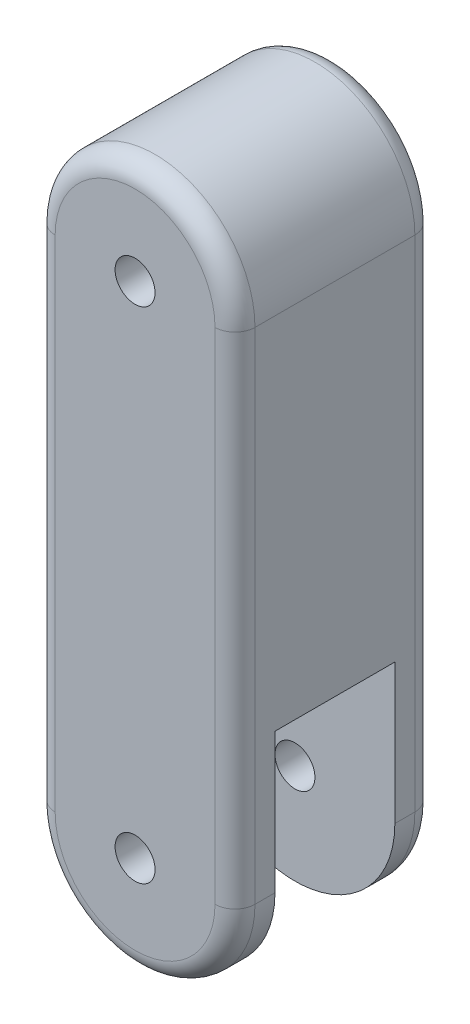
ISO-10303-21;
HEADER;
FILE_DESCRIPTION(('STEP AP214'),'2;1');
FILE_NAME('part.step','',(''),(''),'','','');
FILE_SCHEMA(('AUTOMOTIVE_DESIGN { 1 0 10303 214 1 1 1 1 }'));
ENDSEC;
DATA;
#1=APPLICATION_CONTEXT('core data for automotive mechanical design processes');
#2=APPLICATION_PROTOCOL_DEFINITION('international standard','automotive_design',2000,#1);
#3=PRODUCT_CONTEXT('',#1,'mechanical');
#4=PRODUCT('Part','Part','',(#3));
#5=PRODUCT_RELATED_PRODUCT_CATEGORY('part','',(#4));
#6=PRODUCT_DEFINITION_FORMATION('','',#4);
#7=PRODUCT_DEFINITION_CONTEXT('part definition',#1,'design');
#8=PRODUCT_DEFINITION('design','',#6,#7);
#9=PRODUCT_DEFINITION_SHAPE('','',#8);
#10=(LENGTH_UNIT() NAMED_UNIT(*) SI_UNIT(.MILLI.,.METRE.));
#11=(NAMED_UNIT(*) PLANE_ANGLE_UNIT() SI_UNIT($,.RADIAN.));
#12=(NAMED_UNIT(*) SI_UNIT($,.STERADIAN.) SOLID_ANGLE_UNIT());
#13=UNCERTAINTY_MEASURE_WITH_UNIT(LENGTH_MEASURE(1.E-05),#10,'distance_accuracy_value','');
#14=(GEOMETRIC_REPRESENTATION_CONTEXT(3) GLOBAL_UNCERTAINTY_ASSIGNED_CONTEXT((#13)) GLOBAL_UNIT_ASSIGNED_CONTEXT((#10,
#11,#12)) REPRESENTATION_CONTEXT('',''));
#15=CARTESIAN_POINT('',(0.,0.,0.));
#16=DIRECTION('',(0.,0.,1.));
#17=DIRECTION('',(1.,0.,0.));
#18=AXIS2_PLACEMENT_3D('',#15,#16,#17);
#19=CARTESIAN_POINT('',(2.,0.,0.5));
#20=DIRECTION('',(0.,1.,0.));
#21=DIRECTION('',(-1.,0.,0.));
#22=AXIS2_PLACEMENT_3D('',#19,#20,#21);
#23=CYLINDRICAL_SURFACE('',#22,0.5);
#24=CARTESIAN_POINT('',(2.,-12.5,0.5));
#25=DIRECTION('',(0.,-1.,0.));
#26=DIRECTION('',(0.,0.,-1.));
#27=AXIS2_PLACEMENT_3D('',#24,#25,#26);
#28=CIRCLE('',#27,0.5);
#29=CARTESIAN_POINT('',(2.,-12.5,0.));
#30=VERTEX_POINT('',#29);
#31=CARTESIAN_POINT('',(2.5,-12.5,0.5));
#32=VERTEX_POINT('',#31);
#33=EDGE_CURVE('E11',#30,#32,#28,.T.);
#34=ORIENTED_EDGE('',*,*,#33,.F.);
#35=DIRECTION('',(0.,-1.,0.));
#36=VECTOR('',#35,1.);
#37=CARTESIAN_POINT('',(2.,0.,0.));
#38=LINE('',#37,#36);
#39=CARTESIAN_POINT('',(2.,0.,0.));
#40=VERTEX_POINT('',#39);
#41=EDGE_CURVE('E262',#40,#30,#38,.T.);
#42=ORIENTED_EDGE('',*,*,#41,.F.);
#43=CARTESIAN_POINT('',(2.,0.,0.5));
#44=DIRECTION('',(0.,-1.,0.));
#45=DIRECTION('',(1.,0.,0.));
#46=AXIS2_PLACEMENT_3D('',#43,#44,#45);
#47=CIRCLE('',#46,0.5);
#48=CARTESIAN_POINT('',(2.5,0.,0.5));
#49=VERTEX_POINT('',#48);
#50=EDGE_CURVE('E48',#40,#49,#47,.T.);
#51=ORIENTED_EDGE('',*,*,#50,.T.);
#52=DIRECTION('',(0.,-1.,0.));
#53=VECTOR('',#52,1.);
#54=CARTESIAN_POINT('',(2.5,0.,0.5));
#55=LINE('',#54,#53);
#56=EDGE_CURVE('E289',#32,#49,#55,.F.);
#57=ORIENTED_EDGE('',*,*,#56,.F.);
#58=EDGE_LOOP('',(#34,#42,#51,#57));
#59=FACE_BOUND('',#58,.T.);
#60=ADVANCED_FACE('F40',(#59),#23,.T.);
#61=CARTESIAN_POINT('',(0.,0.,0.5));
#62=DIRECTION('',(0.,0.,1.));
#63=DIRECTION('',(1.,0.,0.));
#64=AXIS2_PLACEMENT_3D('',#61,#62,#63);
#65=TOROIDAL_SURFACE('',#64,2.,0.5);
#66=ORIENTED_EDGE('',*,*,#50,.F.);
#67=CARTESIAN_POINT('',(0.,0.,0.));
#68=DIRECTION('',(0.,0.,1.));
#69=DIRECTION('',(1.,0.,0.));
#70=AXIS2_PLACEMENT_3D('',#67,#68,#69);
#71=CIRCLE('',#70,2.);
#72=CARTESIAN_POINT('',(-2.,0.,0.));
#73=VERTEX_POINT('',#72);
#74=EDGE_CURVE('E266',#73,#40,#71,.F.);
#75=ORIENTED_EDGE('',*,*,#74,.F.);
#76=CARTESIAN_POINT('',(-2.,0.,0.5));
#77=DIRECTION('',(0.,1.,0.));
#78=DIRECTION('',(-1.,0.,0.));
#79=AXIS2_PLACEMENT_3D('',#76,#77,#78);
#80=CIRCLE('',#79,0.5);
#81=CARTESIAN_POINT('',(-2.5,0.,0.5));
#82=VERTEX_POINT('',#81);
#83=EDGE_CURVE('E62',#73,#82,#80,.T.);
#84=ORIENTED_EDGE('',*,*,#83,.T.);
#85=CARTESIAN_POINT('',(0.,0.,0.5));
#86=DIRECTION('',(0.,0.,1.));
#87=DIRECTION('',(1.,0.,0.));
#88=AXIS2_PLACEMENT_3D('',#85,#86,#87);
#89=CIRCLE('',#88,2.5);
#90=EDGE_CURVE('E286',#49,#82,#89,.T.);
#91=ORIENTED_EDGE('',*,*,#90,.F.);
#92=EDGE_LOOP('',(#66,#75,#84,#91));
#93=FACE_BOUND('',#92,.T.);
#94=ADVANCED_FACE('F313',(#93),#65,.T.);
#95=CARTESIAN_POINT('',(-2.,0.,0.5));
#96=DIRECTION('',(0.,1.,0.));
#97=DIRECTION('',(-1.,0.,0.));
#98=AXIS2_PLACEMENT_3D('',#95,#96,#97);
#99=CYLINDRICAL_SURFACE('',#98,0.5);
#100=ORIENTED_EDGE('',*,*,#83,.F.);
#101=DIRECTION('',(0.,1.,0.));
#102=VECTOR('',#101,1.);
#103=CARTESIAN_POINT('',(-2.,0.,0.));
#104=LINE('',#103,#102);
#105=CARTESIAN_POINT('',(-2.,-12.5,0.));
#106=VERTEX_POINT('',#105);
#107=EDGE_CURVE('E270',#106,#73,#104,.T.);
#108=ORIENTED_EDGE('',*,*,#107,.F.);
#109=CARTESIAN_POINT('',(-2.,-12.5,0.5));
#110=DIRECTION('',(0.,1.,0.));
#111=DIRECTION('',(0.,0.,1.));
#112=AXIS2_PLACEMENT_3D('',#109,#110,#111);
#113=CIRCLE('',#112,0.5);
#114=CARTESIAN_POINT('',(-2.5,-12.5,0.5));
#115=VERTEX_POINT('',#114);
#116=EDGE_CURVE('E292',#106,#115,#113,.T.);
#117=ORIENTED_EDGE('',*,*,#116,.T.);
#118=DIRECTION('',(0.,1.,0.));
#119=VECTOR('',#118,1.);
#120=CARTESIAN_POINT('',(-2.5,0.,0.5));
#121=LINE('',#120,#119);
#122=EDGE_CURVE('E282',#82,#115,#121,.F.);
#123=ORIENTED_EDGE('',*,*,#122,.F.);
#124=EDGE_LOOP('',(#100,#108,#117,#123));
#125=FACE_BOUND('',#124,.T.);
#126=ADVANCED_FACE('F318',(#125),#99,.T.);
#127=CARTESIAN_POINT('',(0.,-12.5,0.5));
#128=DIRECTION('',(0.,0.,1.));
#129=DIRECTION('',(1.,0.,0.));
#130=AXIS2_PLACEMENT_3D('',#127,#128,#129);
#131=TOROIDAL_SURFACE('',#130,2.,0.5);
#132=CARTESIAN_POINT('',(0.,-12.5,0.));
#133=DIRECTION('',(0.,0.,1.));
#134=DIRECTION('',(1.,0.,0.));
#135=AXIS2_PLACEMENT_3D('',#132,#133,#134);
#136=CIRCLE('',#135,2.);
#137=EDGE_CURVE('E274',#30,#106,#136,.F.);
#138=ORIENTED_EDGE('',*,*,#137,.F.);
#139=ORIENTED_EDGE('',*,*,#33,.T.);
#140=CARTESIAN_POINT('',(0.,-12.5,0.5));
#141=DIRECTION('',(0.,0.,1.));
#142=DIRECTION('',(1.,0.,0.));
#143=AXIS2_PLACEMENT_3D('',#140,#141,#142);
#144=CIRCLE('',#143,2.5);
#145=EDGE_CURVE('E278',#115,#32,#144,.T.);
#146=ORIENTED_EDGE('',*,*,#145,.F.);
#147=ORIENTED_EDGE('',*,*,#116,.F.);
#148=EDGE_LOOP('',(#138,#139,#146,#147));
#149=FACE_BOUND('',#148,.T.);
#150=ADVANCED_FACE('F311',(#149),#131,.T.);
#151=CARTESIAN_POINT('',(-2.,0.,4.5));
#152=DIRECTION('',(0.,1.,0.));
#153=DIRECTION('',(-1.,0.,0.));
#154=AXIS2_PLACEMENT_3D('',#151,#152,#153);
#155=CYLINDRICAL_SURFACE('',#154,0.5);
#156=CARTESIAN_POINT('',(-2.,-12.5,4.5));
#157=DIRECTION('',(0.,-1.,0.));
#158=DIRECTION('',(0.,0.,-1.));
#159=AXIS2_PLACEMENT_3D('',#156,#157,#158);
#160=CIRCLE('',#159,0.5);
#161=CARTESIAN_POINT('',(-2.,-12.5,5.));
#162=VERTEX_POINT('',#161);
#163=CARTESIAN_POINT('',(-2.5,-12.5,4.5));
#164=VERTEX_POINT('',#163);
#165=EDGE_CURVE('E259',#162,#164,#160,.T.);
#166=ORIENTED_EDGE('',*,*,#165,.F.);
#167=DIRECTION('',(0.,-1.,0.));
#168=VECTOR('',#167,1.);
#169=CARTESIAN_POINT('',(-2.,0.,5.));
#170=LINE('',#169,#168);
#171=CARTESIAN_POINT('',(-2.,0.,5.));
#172=VERTEX_POINT('',#171);
#173=EDGE_CURVE('E212',#172,#162,#170,.T.);
#174=ORIENTED_EDGE('',*,*,#173,.F.);
#175=CARTESIAN_POINT('',(-2.,0.,4.5));
#176=DIRECTION('',(0.,-1.,0.));
#177=DIRECTION('',(1.,0.,0.));
#178=AXIS2_PLACEMENT_3D('',#175,#176,#177);
#179=CIRCLE('',#178,0.5);
#180=CARTESIAN_POINT('',(-2.5,0.,4.5));
#181=VERTEX_POINT('',#180);
#182=EDGE_CURVE('E256',#172,#181,#179,.T.);
#183=ORIENTED_EDGE('',*,*,#182,.T.);
#184=DIRECTION('',(0.,-1.,0.));
#185=VECTOR('',#184,1.);
#186=CARTESIAN_POINT('',(-2.5,0.,4.5));
#187=LINE('',#186,#185);
#188=EDGE_CURVE('E246',#164,#181,#187,.F.);
#189=ORIENTED_EDGE('',*,*,#188,.F.);
#190=EDGE_LOOP('',(#166,#174,#183,#189));
#191=FACE_BOUND('',#190,.T.);
#192=ADVANCED_FACE('F327',(#191),#155,.T.);
#193=CARTESIAN_POINT('',(0.,0.,4.5));
#194=DIRECTION('',(0.,0.,1.));
#195=DIRECTION('',(1.,0.,0.));
#196=AXIS2_PLACEMENT_3D('',#193,#194,#195);
#197=TOROIDAL_SURFACE('',#196,2.,0.5);
#198=ORIENTED_EDGE('',*,*,#182,.F.);
#199=CARTESIAN_POINT('',(0.,0.,5.));
#200=DIRECTION('',(0.,0.,1.));
#201=DIRECTION('',(1.,0.,0.));
#202=AXIS2_PLACEMENT_3D('',#199,#200,#201);
#203=CIRCLE('',#202,2.);
#204=CARTESIAN_POINT('',(2.,0.,5.));
#205=VERTEX_POINT('',#204);
#206=EDGE_CURVE('E222',#205,#172,#203,.T.);
#207=ORIENTED_EDGE('',*,*,#206,.F.);
#208=CARTESIAN_POINT('',(2.,0.,4.5));
#209=DIRECTION('',(0.,1.,0.));
#210=DIRECTION('',(-1.,0.,0.));
#211=AXIS2_PLACEMENT_3D('',#208,#209,#210);
#212=CIRCLE('',#211,0.5);
#213=CARTESIAN_POINT('',(2.5,0.,4.5));
#214=VERTEX_POINT('',#213);
#215=EDGE_CURVE('E253',#205,#214,#212,.T.);
#216=ORIENTED_EDGE('',*,*,#215,.T.);
#217=CARTESIAN_POINT('',(0.,0.,4.5));
#218=DIRECTION('',(0.,0.,1.));
#219=DIRECTION('',(1.,0.,0.));
#220=AXIS2_PLACEMENT_3D('',#217,#218,#219);
#221=CIRCLE('',#220,2.5);
#222=EDGE_CURVE('E242',#181,#214,#221,.F.);
#223=ORIENTED_EDGE('',*,*,#222,.F.);
#224=EDGE_LOOP('',(#198,#207,#216,#223));
#225=FACE_BOUND('',#224,.T.);
#226=ADVANCED_FACE('F330',(#225),#197,.T.);
#227=CARTESIAN_POINT('',(2.,0.,4.5));
#228=DIRECTION('',(0.,1.,0.));
#229=DIRECTION('',(-1.,0.,0.));
#230=AXIS2_PLACEMENT_3D('',#227,#228,#229);
#231=CYLINDRICAL_SURFACE('',#230,0.5);
#232=ORIENTED_EDGE('',*,*,#215,.F.);
#233=DIRECTION('',(0.,1.,0.));
#234=VECTOR('',#233,1.);
#235=CARTESIAN_POINT('',(2.,0.,5.));
#236=LINE('',#235,#234);
#237=CARTESIAN_POINT('',(2.,-12.5,5.));
#238=VERTEX_POINT('',#237);
#239=EDGE_CURVE('E226',#238,#205,#236,.T.);
#240=ORIENTED_EDGE('',*,*,#239,.F.);
#241=CARTESIAN_POINT('',(2.,-12.5,4.5));
#242=DIRECTION('',(0.,1.,0.));
#243=DIRECTION('',(0.,0.,1.));
#244=AXIS2_PLACEMENT_3D('',#241,#242,#243);
#245=CIRCLE('',#244,0.5);
#246=CARTESIAN_POINT('',(2.5,-12.5,4.5));
#247=VERTEX_POINT('',#246);
#248=EDGE_CURVE('E250',#238,#247,#245,.T.);
#249=ORIENTED_EDGE('',*,*,#248,.T.);
#250=DIRECTION('',(0.,1.,0.));
#251=VECTOR('',#250,1.);
#252=CARTESIAN_POINT('',(2.5,0.,4.5));
#253=LINE('',#252,#251);
#254=EDGE_CURVE('E238',#214,#247,#253,.F.);
#255=ORIENTED_EDGE('',*,*,#254,.F.);
#256=EDGE_LOOP('',(#232,#240,#249,#255));
#257=FACE_BOUND('',#256,.T.);
#258=ADVANCED_FACE('F334',(#257),#231,.T.);
#259=CARTESIAN_POINT('',(0.,-12.5,4.5));
#260=DIRECTION('',(0.,0.,1.));
#261=DIRECTION('',(1.,0.,0.));
#262=AXIS2_PLACEMENT_3D('',#259,#260,#261);
#263=TOROIDAL_SURFACE('',#262,2.,0.5);
#264=CARTESIAN_POINT('',(0.,-12.5,5.));
#265=DIRECTION('',(0.,0.,1.));
#266=DIRECTION('',(1.,0.,0.));
#267=AXIS2_PLACEMENT_3D('',#264,#265,#266);
#268=CIRCLE('',#267,2.);
#269=EDGE_CURVE('E230',#162,#238,#268,.T.);
#270=ORIENTED_EDGE('',*,*,#269,.F.);
#271=ORIENTED_EDGE('',*,*,#165,.T.);
#272=CARTESIAN_POINT('',(0.,-12.5,4.5));
#273=DIRECTION('',(0.,0.,1.));
#274=DIRECTION('',(1.,0.,0.));
#275=AXIS2_PLACEMENT_3D('',#272,#273,#274);
#276=CIRCLE('',#275,2.5);
#277=EDGE_CURVE('E234',#247,#164,#276,.F.);
#278=ORIENTED_EDGE('',*,*,#277,.F.);
#279=ORIENTED_EDGE('',*,*,#248,.F.);
#280=EDGE_LOOP('',(#270,#271,#278,#279));
#281=FACE_BOUND('',#280,.T.);
#282=ADVANCED_FACE('F338',(#281),#263,.T.);
#283=CARTESIAN_POINT('',(0.,-12.5,5.));
#284=DIRECTION('',(0.,0.,-1.));
#285=DIRECTION('',(-1.,0.,0.));
#286=AXIS2_PLACEMENT_3D('',#283,#284,#285);
#287=CYLINDRICAL_SURFACE('',#286,2.5);
#288=DIRECTION('',(0.,0.,-1.));
#289=VECTOR('',#288,1.);
#290=CARTESIAN_POINT('',(-2.5,-12.5,5.));
#291=LINE('',#290,#289);
#292=CARTESIAN_POINT('',(-2.5,-12.5,0.999999999999999));
#293=VERTEX_POINT('',#292);
#294=EDGE_CURVE('E208',#293,#115,#291,.T.);
#295=ORIENTED_EDGE('',*,*,#294,.T.);
#296=ORIENTED_EDGE('',*,*,#145,.T.);
#297=DIRECTION('',(0.,0.,-1.));
#298=VECTOR('',#297,1.);
#299=CARTESIAN_POINT('',(2.5,-12.5,5.));
#300=LINE('',#299,#298);
#301=CARTESIAN_POINT('',(2.5,-12.5,0.999999999999999));
#302=VERTEX_POINT('',#301);
#303=EDGE_CURVE('E204',#302,#32,#300,.T.);
#304=ORIENTED_EDGE('',*,*,#303,.F.);
#305=CARTESIAN_POINT('',(0.,-12.5,0.999999999999999));
#306=DIRECTION('',(0.,0.,-1.));
#307=DIRECTION('',(-1.,0.,0.));
#308=AXIS2_PLACEMENT_3D('',#305,#306,#307);
#309=CIRCLE('',#308,2.5);
#310=EDGE_CURVE('E177',#302,#293,#309,.T.);
#311=ORIENTED_EDGE('',*,*,#310,.T.);
#312=EDGE_LOOP('',(#295,#296,#304,#311));
#313=FACE_BOUND('',#312,.T.);
#314=ADVANCED_FACE('F307',(#313),#287,.T.);
#315=CARTESIAN_POINT('',(0.,-12.5,5.));
#316=DIRECTION('',(0.,0.,-1.));
#317=DIRECTION('',(-1.,0.,0.));
#318=AXIS2_PLACEMENT_3D('',#315,#316,#317);
#319=CYLINDRICAL_SURFACE('',#318,0.5);
#320=CARTESIAN_POINT('',(0.,-12.5,0.999999999999999));
#321=DIRECTION('',(0.,0.,-1.));
#322=DIRECTION('',(-1.,0.,0.));
#323=AXIS2_PLACEMENT_3D('',#320,#321,#322);
#324=CIRCLE('',#323,0.5);
#325=CARTESIAN_POINT('',(-0.499999999999998,-12.5,0.999999999999999));
#326=VERTEX_POINT('',#325);
#327=EDGE_CURVE('E176',#326,#326,#324,.T.);
#328=ORIENTED_EDGE('',*,*,#327,.F.);
#329=EDGE_LOOP('',(#328));
#330=FACE_BOUND('',#329,.T.);
#331=CARTESIAN_POINT('',(0.,-12.5,0.));
#332=DIRECTION('',(0.,0.,1.));
#333=DIRECTION('',(1.,0.,0.));
#334=AXIS2_PLACEMENT_3D('',#331,#332,#333);
#335=CIRCLE('',#334,0.5);
#336=CARTESIAN_POINT('',(0.500000000000002,-12.5,0.));
#337=VERTEX_POINT('',#336);
#338=EDGE_CURVE('E181',#337,#337,#335,.T.);
#339=ORIENTED_EDGE('',*,*,#338,.F.);
#340=EDGE_LOOP('',(#339));
#341=FACE_BOUND('',#340,.T.);
#342=ADVANCED_FACE('F349',(#330,#341),#319,.F.);
#343=CARTESIAN_POINT('',(-2.5,0.,5.));
#344=DIRECTION('',(1.,0.,0.));
#345=DIRECTION('',(0.,1.,0.));
#346=AXIS2_PLACEMENT_3D('',#343,#344,#345);
#347=PLANE('',#346);
#348=DIRECTION('',(0.,0.,-1.));
#349=VECTOR('',#348,1.);
#350=CARTESIAN_POINT('',(-2.5,0.,5.));
#351=LINE('',#350,#349);
#352=EDGE_CURVE('E191',#181,#82,#351,.T.);
#353=ORIENTED_EDGE('',*,*,#352,.T.);
#354=ORIENTED_EDGE('',*,*,#122,.T.);
#355=ORIENTED_EDGE('',*,*,#294,.F.);
#356=DIRECTION('',(0.,1.,0.));
#357=VECTOR('',#356,1.);
#358=CARTESIAN_POINT('',(-2.5,0.,0.999999999999999));
#359=LINE('',#358,#357);
#360=CARTESIAN_POINT('',(-2.5,-9.,0.999999999999999));
#361=VERTEX_POINT('',#360);
#362=EDGE_CURVE('E142',#293,#361,#359,.T.);
#363=ORIENTED_EDGE('',*,*,#362,.T.);
#364=DIRECTION('',(0.,0.,-1.));
#365=VECTOR('',#364,1.);
#366=CARTESIAN_POINT('',(-2.5,-9.,0.));
#367=LINE('',#366,#365);
#368=CARTESIAN_POINT('',(-2.5,-9.,4.));
#369=VERTEX_POINT('',#368);
#370=EDGE_CURVE('E133',#369,#361,#367,.T.);
#371=ORIENTED_EDGE('',*,*,#370,.F.);
#372=DIRECTION('',(0.,-1.,0.));
#373=VECTOR('',#372,1.);
#374=CARTESIAN_POINT('',(-2.5,0.,4.));
#375=LINE('',#374,#373);
#376=CARTESIAN_POINT('',(-2.5,-12.5,4.));
#377=VERTEX_POINT('',#376);
#378=EDGE_CURVE('E146',#369,#377,#375,.T.);
#379=ORIENTED_EDGE('',*,*,#378,.T.);
#380=EDGE_CURVE('E209',#164,#377,#291,.T.);
#381=ORIENTED_EDGE('',*,*,#380,.F.);
#382=ORIENTED_EDGE('',*,*,#188,.T.);
#383=EDGE_LOOP('',(#353,#354,#355,#363,#371,#379,#381,#382));
#384=FACE_BOUND('',#383,.T.);
#385=ADVANCED_FACE('F156',(#384),#347,.F.);
#386=CARTESIAN_POINT('',(2.5,-12.5,4.));
#387=VERTEX_POINT('',#386);
#388=EDGE_CURVE('E205',#247,#387,#300,.T.);
#389=ORIENTED_EDGE('',*,*,#388,.F.);
#390=ORIENTED_EDGE('',*,*,#277,.T.);
#391=ORIENTED_EDGE('',*,*,#380,.T.);
#392=CARTESIAN_POINT('',(0.,-12.5,4.));
#393=DIRECTION('',(0.,0.,1.));
#394=DIRECTION('',(0.,-1.,0.));
#395=AXIS2_PLACEMENT_3D('',#392,#393,#394);
#396=CIRCLE('',#395,2.5);
#397=EDGE_CURVE('E149',#377,#387,#396,.T.);
#398=ORIENTED_EDGE('',*,*,#397,.T.);
#399=EDGE_LOOP('',(#389,#390,#391,#398));
#400=FACE_BOUND('',#399,.T.);
#401=ADVANCED_FACE('F355',(#400),#287,.T.);
#402=CARTESIAN_POINT('',(2.5,0.,5.));
#403=DIRECTION('',(1.,0.,0.));
#404=DIRECTION('',(0.,1.,0.));
#405=AXIS2_PLACEMENT_3D('',#402,#403,#404);
#406=PLANE('',#405);
#407=ORIENTED_EDGE('',*,*,#303,.T.);
#408=ORIENTED_EDGE('',*,*,#56,.T.);
#409=DIRECTION('',(0.,0.,-1.));
#410=VECTOR('',#409,1.);
#411=CARTESIAN_POINT('',(2.5,0.,5.));
#412=LINE('',#411,#410);
#413=EDGE_CURVE('E200',#214,#49,#412,.T.);
#414=ORIENTED_EDGE('',*,*,#413,.F.);
#415=ORIENTED_EDGE('',*,*,#254,.T.);
#416=ORIENTED_EDGE('',*,*,#388,.T.);
#417=DIRECTION('',(0.,-1.,0.));
#418=VECTOR('',#417,1.);
#419=CARTESIAN_POINT('',(2.5,0.,4.));
#420=LINE('',#419,#418);
#421=CARTESIAN_POINT('',(2.5,-9.,4.));
#422=VERTEX_POINT('',#421);
#423=EDGE_CURVE('E162',#422,#387,#420,.T.);
#424=ORIENTED_EDGE('',*,*,#423,.F.);
#425=DIRECTION('',(0.,0.,-1.));
#426=VECTOR('',#425,1.);
#427=CARTESIAN_POINT('',(2.5,-9.,0.));
#428=LINE('',#427,#426);
#429=CARTESIAN_POINT('',(2.5,-9.,0.999999999999999));
#430=VERTEX_POINT('',#429);
#431=EDGE_CURVE('E136',#422,#430,#428,.T.);
#432=ORIENTED_EDGE('',*,*,#431,.T.);
#433=DIRECTION('',(0.,1.,0.));
#434=VECTOR('',#433,1.);
#435=CARTESIAN_POINT('',(2.5,0.,0.999999999999999));
#436=LINE('',#435,#434);
#437=EDGE_CURVE('E159',#302,#430,#436,.T.);
#438=ORIENTED_EDGE('',*,*,#437,.F.);
#439=EDGE_LOOP('',(#407,#408,#414,#415,#416,#424,#432,#438));
#440=FACE_BOUND('',#439,.T.);
#441=ADVANCED_FACE('F304',(#440),#406,.T.);
#442=CARTESIAN_POINT('',(0.,0.,5.));
#443=DIRECTION('',(0.,0.,-1.));
#444=DIRECTION('',(-1.,0.,0.));
#445=AXIS2_PLACEMENT_3D('',#442,#443,#444);
#446=CYLINDRICAL_SURFACE('',#445,0.5);
#447=CARTESIAN_POINT('',(0.,0.,5.));
#448=DIRECTION('',(0.,0.,1.));
#449=DIRECTION('',(1.,0.,0.));
#450=AXIS2_PLACEMENT_3D('',#447,#448,#449);
#451=CIRCLE('',#450,0.5);
#452=CARTESIAN_POINT('',(0.5,0.,5.));
#453=VERTEX_POINT('',#452);
#454=EDGE_CURVE('E186',#453,#453,#451,.T.);
#455=ORIENTED_EDGE('',*,*,#454,.T.);
#456=EDGE_LOOP('',(#455));
#457=FACE_BOUND('',#456,.T.);
#458=CARTESIAN_POINT('',(0.,0.,0.));
#459=DIRECTION('',(0.,0.,1.));
#460=DIRECTION('',(1.,0.,0.));
#461=AXIS2_PLACEMENT_3D('',#458,#459,#460);
#462=CIRCLE('',#461,0.5);
#463=CARTESIAN_POINT('',(0.5,0.,0.));
#464=VERTEX_POINT('',#463);
#465=EDGE_CURVE('E187',#464,#464,#462,.T.);
#466=ORIENTED_EDGE('',*,*,#465,.F.);
#467=EDGE_LOOP('',(#466));
#468=FACE_BOUND('',#467,.T.);
#469=ADVANCED_FACE('F347',(#457,#468),#446,.F.);
#470=CARTESIAN_POINT('',(0.,-12.5,4.));
#471=DIRECTION('',(0.,0.,1.));
#472=DIRECTION('',(0.,-1.,0.));
#473=AXIS2_PLACEMENT_3D('',#470,#471,#472);
#474=CIRCLE('',#473,0.5);
#475=CARTESIAN_POINT('',(0.,-13.,4.));
#476=VERTEX_POINT('',#475);
#477=EDGE_CURVE('E172',#476,#476,#474,.T.);
#478=ORIENTED_EDGE('',*,*,#477,.F.);
#479=EDGE_LOOP('',(#478));
#480=FACE_BOUND('',#479,.T.);
#481=CARTESIAN_POINT('',(0.,-12.5,5.));
#482=DIRECTION('',(0.,0.,1.));
#483=DIRECTION('',(1.,0.,0.));
#484=AXIS2_PLACEMENT_3D('',#481,#482,#483);
#485=CIRCLE('',#484,0.5);
#486=CARTESIAN_POINT('',(0.500000000000002,-12.5,5.));
#487=VERTEX_POINT('',#486);
#488=EDGE_CURVE('E182',#487,#487,#485,.T.);
#489=ORIENTED_EDGE('',*,*,#488,.T.);
#490=EDGE_LOOP('',(#489));
#491=FACE_BOUND('',#490,.T.);
#492=ADVANCED_FACE('F343',(#480,#491),#319,.F.);
#493=CARTESIAN_POINT('',(0.,0.,5.));
#494=DIRECTION('',(0.,0.,-1.));
#495=DIRECTION('',(-1.,0.,0.));
#496=AXIS2_PLACEMENT_3D('',#493,#494,#495);
#497=CYLINDRICAL_SURFACE('',#496,2.5);
#498=ORIENTED_EDGE('',*,*,#413,.T.);
#499=ORIENTED_EDGE('',*,*,#90,.T.);
#500=ORIENTED_EDGE('',*,*,#352,.F.);
#501=ORIENTED_EDGE('',*,*,#222,.T.);
#502=EDGE_LOOP('',(#498,#499,#500,#501));
#503=FACE_BOUND('',#502,.T.);
#504=ADVANCED_FACE('F346',(#503),#497,.T.);
#505=CARTESIAN_POINT('',(0.,0.,5.));
#506=DIRECTION('',(0.,0.,1.));
#507=DIRECTION('',(1.,0.,0.));
#508=AXIS2_PLACEMENT_3D('',#505,#506,#507);
#509=PLANE('',#508);
#510=ORIENTED_EDGE('',*,*,#173,.T.);
#511=ORIENTED_EDGE('',*,*,#269,.T.);
#512=ORIENTED_EDGE('',*,*,#239,.T.);
#513=ORIENTED_EDGE('',*,*,#206,.T.);
#514=EDGE_LOOP('',(#510,#511,#512,#513));
#515=FACE_BOUND('',#514,.T.);
#516=ORIENTED_EDGE('',*,*,#488,.F.);
#517=EDGE_LOOP('',(#516));
#518=FACE_BOUND('',#517,.T.);
#519=ORIENTED_EDGE('',*,*,#454,.F.);
#520=EDGE_LOOP('',(#519));
#521=FACE_BOUND('',#520,.T.);
#522=ADVANCED_FACE('F363',(#515,#518,#521),#509,.T.);
#523=CARTESIAN_POINT('',(0.,0.,0.));
#524=DIRECTION('',(0.,0.,1.));
#525=DIRECTION('',(1.,0.,0.));
#526=AXIS2_PLACEMENT_3D('',#523,#524,#525);
#527=PLANE('',#526);
#528=ORIENTED_EDGE('',*,*,#41,.T.);
#529=ORIENTED_EDGE('',*,*,#137,.T.);
#530=ORIENTED_EDGE('',*,*,#107,.T.);
#531=ORIENTED_EDGE('',*,*,#74,.T.);
#532=EDGE_LOOP('',(#528,#529,#530,#531));
#533=FACE_BOUND('',#532,.T.);
#534=ORIENTED_EDGE('',*,*,#338,.T.);
#535=EDGE_LOOP('',(#534));
#536=FACE_BOUND('',#535,.T.);
#537=ORIENTED_EDGE('',*,*,#465,.T.);
#538=EDGE_LOOP('',(#537));
#539=FACE_BOUND('',#538,.T.);
#540=ADVANCED_FACE('F365',(#533,#536,#539),#527,.F.);
#541=CARTESIAN_POINT('',(-2.5,0.,0.999999999999999));
#542=DIRECTION('',(0.,0.,-1.));
#543=DIRECTION('',(-1.,0.,0.));
#544=AXIS2_PLACEMENT_3D('',#541,#542,#543);
#545=PLANE('',#544);
#546=ORIENTED_EDGE('',*,*,#327,.T.);
#547=EDGE_LOOP('',(#546));
#548=FACE_BOUND('',#547,.T.);
#549=ORIENTED_EDGE('',*,*,#437,.T.);
#550=DIRECTION('',(1.,0.,0.));
#551=VECTOR('',#550,1.);
#552=CARTESIAN_POINT('',(-2.5,-9.,0.999999999999999));
#553=LINE('',#552,#551);
#554=EDGE_CURVE('E141',#361,#430,#553,.T.);
#555=ORIENTED_EDGE('',*,*,#554,.F.);
#556=ORIENTED_EDGE('',*,*,#362,.F.);
#557=ORIENTED_EDGE('',*,*,#310,.F.);
#558=EDGE_LOOP('',(#549,#555,#556,#557));
#559=FACE_BOUND('',#558,.T.);
#560=ADVANCED_FACE('F368',(#548,#559),#545,.F.);
#561=CARTESIAN_POINT('',(-2.5,0.,4.));
#562=DIRECTION('',(0.,0.,1.));
#563=DIRECTION('',(0.,-1.,0.));
#564=AXIS2_PLACEMENT_3D('',#561,#562,#563);
#565=PLANE('',#564);
#566=ORIENTED_EDGE('',*,*,#477,.T.);
#567=EDGE_LOOP('',(#566));
#568=FACE_BOUND('',#567,.T.);
#569=ORIENTED_EDGE('',*,*,#378,.F.);
#570=DIRECTION('',(1.,0.,0.));
#571=VECTOR('',#570,1.);
#572=CARTESIAN_POINT('',(-2.5,-9.,4.));
#573=LINE('',#572,#571);
#574=EDGE_CURVE('E128',#369,#422,#573,.T.);
#575=ORIENTED_EDGE('',*,*,#574,.T.);
#576=ORIENTED_EDGE('',*,*,#423,.T.);
#577=ORIENTED_EDGE('',*,*,#397,.F.);
#578=EDGE_LOOP('',(#569,#575,#576,#577));
#579=FACE_BOUND('',#578,.T.);
#580=ADVANCED_FACE('F147',(#568,#579),#565,.F.);
#581=CARTESIAN_POINT('',(-2.5,-9.,0.));
#582=DIRECTION('',(0.,-1.,0.));
#583=DIRECTION('',(1.,0.,0.));
#584=AXIS2_PLACEMENT_3D('',#581,#582,#583);
#585=PLANE('',#584);
#586=ORIENTED_EDGE('',*,*,#431,.F.);
#587=ORIENTED_EDGE('',*,*,#574,.F.);
#588=ORIENTED_EDGE('',*,*,#370,.T.);
#589=ORIENTED_EDGE('',*,*,#554,.T.);
#590=EDGE_LOOP('',(#586,#587,#588,#589));
#591=FACE_BOUND('',#590,.T.);
#592=ADVANCED_FACE('F130',(#591),#585,.T.);
#593=CLOSED_SHELL('',(#60,#94,#126,#150,#192,#226,#258,#282,#314,#342,#385,#401,#441,#469,#492,
#504,#522,#540,#560,#580,#592));
#594=MANIFOLD_SOLID_BREP('B2',#593);
#595=ADVANCED_BREP_SHAPE_REPRESENTATION('',(#18,#594),#14);
#596=SHAPE_DEFINITION_REPRESENTATION(#9,#595);
ENDSEC;
END-ISO-10303-21;
